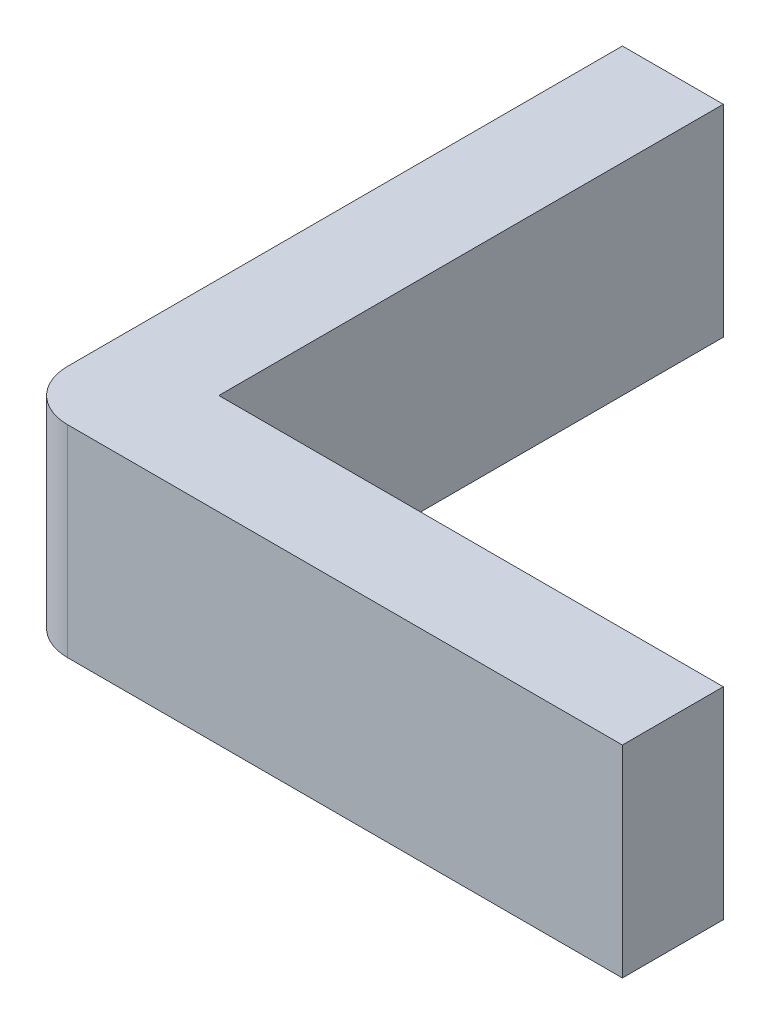
ISO-10303-21;
HEADER;
FILE_DESCRIPTION(('STEP AP214'),'2;1');
FILE_NAME('part.step','',(''),(''),'','','');
FILE_SCHEMA(('AUTOMOTIVE_DESIGN { 1 0 10303 214 1 1 1 1 }'));
ENDSEC;
DATA;
#1=APPLICATION_CONTEXT('core data for automotive mechanical design processes');
#2=APPLICATION_PROTOCOL_DEFINITION('international standard','automotive_design',2000,#1);
#3=PRODUCT_CONTEXT('',#1,'mechanical');
#4=PRODUCT('Part','Part','',(#3));
#5=PRODUCT_RELATED_PRODUCT_CATEGORY('part','',(#4));
#6=PRODUCT_DEFINITION_FORMATION('','',#4);
#7=PRODUCT_DEFINITION_CONTEXT('part definition',#1,'design');
#8=PRODUCT_DEFINITION('design','',#6,#7);
#9=PRODUCT_DEFINITION_SHAPE('','',#8);
#10=(LENGTH_UNIT() NAMED_UNIT(*) SI_UNIT(.MILLI.,.METRE.));
#11=(NAMED_UNIT(*) PLANE_ANGLE_UNIT() SI_UNIT($,.RADIAN.));
#12=(NAMED_UNIT(*) SI_UNIT($,.STERADIAN.) SOLID_ANGLE_UNIT());
#13=UNCERTAINTY_MEASURE_WITH_UNIT(LENGTH_MEASURE(1.E-05),#10,'distance_accuracy_value','');
#14=(GEOMETRIC_REPRESENTATION_CONTEXT(3) GLOBAL_UNCERTAINTY_ASSIGNED_CONTEXT((#13)) GLOBAL_UNIT_ASSIGNED_CONTEXT((#10,
#11,#12)) REPRESENTATION_CONTEXT('',''));
#15=CARTESIAN_POINT('',(0.,0.,0.));
#16=DIRECTION('',(0.,0.,1.));
#17=DIRECTION('',(1.,0.,0.));
#18=AXIS2_PLACEMENT_3D('',#15,#16,#17);
#19=CARTESIAN_POINT('',(0.,4.,-12.));
#20=DIRECTION('',(1.,0.,0.));
#21=DIRECTION('',(0.,0.,-1.));
#22=AXIS2_PLACEMENT_3D('',#19,#20,#21);
#23=PLANE('',#22);
#24=DIRECTION('',(0.,0.,1.));
#25=VECTOR('',#24,1.);
#26=CARTESIAN_POINT('',(0.,0.,-12.));
#27=LINE('',#26,#25);
#28=CARTESIAN_POINT('',(0.,0.,-12.));
#29=VERTEX_POINT('',#28);
#30=CARTESIAN_POINT('',(0.,0.,-0.999999999999999));
#31=VERTEX_POINT('',#30);
#32=EDGE_CURVE('E130',#29,#31,#27,.T.);
#33=ORIENTED_EDGE('',*,*,#32,.T.);
#34=DIRECTION('',(0.,-1.,0.));
#35=VECTOR('',#34,1.);
#36=CARTESIAN_POINT('',(0.,4.,-0.999999999999999));
#37=LINE('',#36,#35);
#38=CARTESIAN_POINT('',(0.,4.,-0.999999999999999));
#39=VERTEX_POINT('',#38);
#40=EDGE_CURVE('E46',#31,#39,#37,.F.);
#41=ORIENTED_EDGE('',*,*,#40,.T.);
#42=DIRECTION('',(0.,0.,1.));
#43=VECTOR('',#42,1.);
#44=CARTESIAN_POINT('',(0.,4.,-12.));
#45=LINE('',#44,#43);
#46=CARTESIAN_POINT('',(0.,4.,-12.));
#47=VERTEX_POINT('',#46);
#48=EDGE_CURVE('E106',#47,#39,#45,.T.);
#49=ORIENTED_EDGE('',*,*,#48,.F.);
#50=DIRECTION('',(0.,-1.,0.));
#51=VECTOR('',#50,1.);
#52=CARTESIAN_POINT('',(0.,4.,-12.));
#53=LINE('',#52,#51);
#54=EDGE_CURVE('E129',#47,#29,#53,.T.);
#55=ORIENTED_EDGE('',*,*,#54,.T.);
#56=EDGE_LOOP('',(#33,#41,#49,#55));
#57=FACE_BOUND('',#56,.T.);
#58=ADVANCED_FACE('F38',(#57),#23,.F.);
#59=CARTESIAN_POINT('',(0.,4.,0.));
#60=DIRECTION('',(0.,0.,-1.));
#61=DIRECTION('',(-1.,0.,0.));
#62=AXIS2_PLACEMENT_3D('',#59,#60,#61);
#63=PLANE('',#62);
#64=DIRECTION('',(1.,0.,0.));
#65=VECTOR('',#64,1.);
#66=CARTESIAN_POINT('',(0.,4.,0.));
#67=LINE('',#66,#65);
#68=CARTESIAN_POINT('',(1.,4.,0.));
#69=VERTEX_POINT('',#68);
#70=CARTESIAN_POINT('',(12.,4.,0.));
#71=VERTEX_POINT('',#70);
#72=EDGE_CURVE('E96',#69,#71,#67,.T.);
#73=ORIENTED_EDGE('',*,*,#72,.F.);
#74=DIRECTION('',(0.,-1.,0.));
#75=VECTOR('',#74,1.);
#76=CARTESIAN_POINT('',(1.,4.,0.));
#77=LINE('',#76,#75);
#78=CARTESIAN_POINT('',(1.,0.,0.));
#79=VERTEX_POINT('',#78);
#80=EDGE_CURVE('E114',#69,#79,#77,.T.);
#81=ORIENTED_EDGE('',*,*,#80,.T.);
#82=DIRECTION('',(1.,0.,0.));
#83=VECTOR('',#82,1.);
#84=CARTESIAN_POINT('',(0.,0.,0.));
#85=LINE('',#84,#83);
#86=CARTESIAN_POINT('',(12.,0.,0.));
#87=VERTEX_POINT('',#86);
#88=EDGE_CURVE('E111',#79,#87,#85,.T.);
#89=ORIENTED_EDGE('',*,*,#88,.T.);
#90=DIRECTION('',(0.,-1.,0.));
#91=VECTOR('',#90,1.);
#92=CARTESIAN_POINT('',(12.,4.,0.));
#93=LINE('',#92,#91);
#94=EDGE_CURVE('E109',#71,#87,#93,.T.);
#95=ORIENTED_EDGE('',*,*,#94,.F.);
#96=EDGE_LOOP('',(#73,#81,#89,#95));
#97=FACE_BOUND('',#96,.T.);
#98=ADVANCED_FACE('F110',(#97),#63,.F.);
#99=CARTESIAN_POINT('',(12.,4.,0.));
#100=DIRECTION('',(-1.,0.,0.));
#101=DIRECTION('',(0.,0.,1.));
#102=AXIS2_PLACEMENT_3D('',#99,#100,#101);
#103=PLANE('',#102);
#104=DIRECTION('',(0.,0.,-1.));
#105=VECTOR('',#104,1.);
#106=CARTESIAN_POINT('',(12.,0.,0.));
#107=LINE('',#106,#105);
#108=CARTESIAN_POINT('',(12.,0.,-2.));
#109=VERTEX_POINT('',#108);
#110=EDGE_CURVE('E133',#87,#109,#107,.T.);
#111=ORIENTED_EDGE('',*,*,#110,.T.);
#112=DIRECTION('',(0.,-1.,0.));
#113=VECTOR('',#112,1.);
#114=CARTESIAN_POINT('',(12.,4.,-2.));
#115=LINE('',#114,#113);
#116=CARTESIAN_POINT('',(12.,4.,-2.));
#117=VERTEX_POINT('',#116);
#118=EDGE_CURVE('E115',#117,#109,#115,.T.);
#119=ORIENTED_EDGE('',*,*,#118,.F.);
#120=DIRECTION('',(0.,0.,-1.));
#121=VECTOR('',#120,1.);
#122=CARTESIAN_POINT('',(12.,4.,0.));
#123=LINE('',#122,#121);
#124=EDGE_CURVE('E100',#71,#117,#123,.T.);
#125=ORIENTED_EDGE('',*,*,#124,.F.);
#126=ORIENTED_EDGE('',*,*,#94,.T.);
#127=EDGE_LOOP('',(#111,#119,#125,#126));
#128=FACE_BOUND('',#127,.T.);
#129=ADVANCED_FACE('F117',(#128),#103,.F.);
#130=CARTESIAN_POINT('',(12.,4.,-2.));
#131=DIRECTION('',(0.,0.,1.));
#132=DIRECTION('',(1.,0.,0.));
#133=AXIS2_PLACEMENT_3D('',#130,#131,#132);
#134=PLANE('',#133);
#135=DIRECTION('',(-1.,0.,0.));
#136=VECTOR('',#135,1.);
#137=CARTESIAN_POINT('',(12.,0.,-2.));
#138=LINE('',#137,#136);
#139=CARTESIAN_POINT('',(2.,0.,-2.));
#140=VERTEX_POINT('',#139);
#141=EDGE_CURVE('E135',#109,#140,#138,.T.);
#142=ORIENTED_EDGE('',*,*,#141,.T.);
#143=DIRECTION('',(0.,-1.,0.));
#144=VECTOR('',#143,1.);
#145=CARTESIAN_POINT('',(2.,4.,-2.));
#146=LINE('',#145,#144);
#147=CARTESIAN_POINT('',(2.,4.,-2.));
#148=VERTEX_POINT('',#147);
#149=EDGE_CURVE('E146',#148,#140,#146,.T.);
#150=ORIENTED_EDGE('',*,*,#149,.F.);
#151=DIRECTION('',(-1.,0.,0.));
#152=VECTOR('',#151,1.);
#153=CARTESIAN_POINT('',(12.,4.,-2.));
#154=LINE('',#153,#152);
#155=EDGE_CURVE('E120',#117,#148,#154,.T.);
#156=ORIENTED_EDGE('',*,*,#155,.F.);
#157=ORIENTED_EDGE('',*,*,#118,.T.);
#158=EDGE_LOOP('',(#142,#150,#156,#157));
#159=FACE_BOUND('',#158,.T.);
#160=ADVANCED_FACE('F156',(#159),#134,.F.);
#161=CARTESIAN_POINT('',(2.,4.,-2.));
#162=DIRECTION('',(-1.,0.,0.));
#163=DIRECTION('',(0.,0.,1.));
#164=AXIS2_PLACEMENT_3D('',#161,#162,#163);
#165=PLANE('',#164);
#166=DIRECTION('',(0.,0.,-1.));
#167=VECTOR('',#166,1.);
#168=CARTESIAN_POINT('',(2.,0.,-2.));
#169=LINE('',#168,#167);
#170=CARTESIAN_POINT('',(2.,0.,-12.));
#171=VERTEX_POINT('',#170);
#172=EDGE_CURVE('E137',#140,#171,#169,.T.);
#173=ORIENTED_EDGE('',*,*,#172,.T.);
#174=DIRECTION('',(0.,-1.,0.));
#175=VECTOR('',#174,1.);
#176=CARTESIAN_POINT('',(2.,4.,-12.));
#177=LINE('',#176,#175);
#178=CARTESIAN_POINT('',(2.,4.,-12.));
#179=VERTEX_POINT('',#178);
#180=EDGE_CURVE('E143',#179,#171,#177,.T.);
#181=ORIENTED_EDGE('',*,*,#180,.F.);
#182=DIRECTION('',(0.,0.,-1.));
#183=VECTOR('',#182,1.);
#184=CARTESIAN_POINT('',(2.,4.,-2.));
#185=LINE('',#184,#183);
#186=EDGE_CURVE('E122',#148,#179,#185,.T.);
#187=ORIENTED_EDGE('',*,*,#186,.F.);
#188=ORIENTED_EDGE('',*,*,#149,.T.);
#189=EDGE_LOOP('',(#173,#181,#187,#188));
#190=FACE_BOUND('',#189,.T.);
#191=ADVANCED_FACE('F163',(#190),#165,.F.);
#192=CARTESIAN_POINT('',(2.,4.,-12.));
#193=DIRECTION('',(0.,0.,1.));
#194=DIRECTION('',(1.,0.,0.));
#195=AXIS2_PLACEMENT_3D('',#192,#193,#194);
#196=PLANE('',#195);
#197=DIRECTION('',(-1.,0.,0.));
#198=VECTOR('',#197,1.);
#199=CARTESIAN_POINT('',(2.,0.,-12.));
#200=LINE('',#199,#198);
#201=EDGE_CURVE('E139',#171,#29,#200,.T.);
#202=ORIENTED_EDGE('',*,*,#201,.T.);
#203=ORIENTED_EDGE('',*,*,#54,.F.);
#204=DIRECTION('',(-1.,0.,0.));
#205=VECTOR('',#204,1.);
#206=CARTESIAN_POINT('',(2.,4.,-12.));
#207=LINE('',#206,#205);
#208=EDGE_CURVE('E127',#179,#47,#207,.T.);
#209=ORIENTED_EDGE('',*,*,#208,.F.);
#210=ORIENTED_EDGE('',*,*,#180,.T.);
#211=EDGE_LOOP('',(#202,#203,#209,#210));
#212=FACE_BOUND('',#211,.T.);
#213=ADVANCED_FACE('F166',(#212),#196,.F.);
#214=CARTESIAN_POINT('',(0.,4.,0.));
#215=DIRECTION('',(0.,1.,0.));
#216=DIRECTION('',(0.,0.,1.));
#217=AXIS2_PLACEMENT_3D('',#214,#215,#216);
#218=PLANE('',#217);
#219=ORIENTED_EDGE('',*,*,#48,.T.);
#220=CARTESIAN_POINT('',(1.,4.,-1.));
#221=DIRECTION('',(0.,1.,0.));
#222=DIRECTION('',(0.,0.,1.));
#223=AXIS2_PLACEMENT_3D('',#220,#221,#222);
#224=CIRCLE('',#223,1.);
#225=EDGE_CURVE('E11',#39,#69,#224,.T.);
#226=ORIENTED_EDGE('',*,*,#225,.T.);
#227=ORIENTED_EDGE('',*,*,#72,.T.);
#228=ORIENTED_EDGE('',*,*,#124,.T.);
#229=ORIENTED_EDGE('',*,*,#155,.T.);
#230=ORIENTED_EDGE('',*,*,#186,.T.);
#231=ORIENTED_EDGE('',*,*,#208,.T.);
#232=EDGE_LOOP('',(#219,#226,#227,#228,#229,#230,#231));
#233=FACE_BOUND('',#232,.T.);
#234=ADVANCED_FACE('F98',(#233),#218,.T.);
#235=CARTESIAN_POINT('',(0.,0.,0.));
#236=DIRECTION('',(0.,1.,0.));
#237=DIRECTION('',(0.,0.,1.));
#238=AXIS2_PLACEMENT_3D('',#235,#236,#237);
#239=PLANE('',#238);
#240=ORIENTED_EDGE('',*,*,#88,.F.);
#241=CARTESIAN_POINT('',(1.,0.,-1.));
#242=DIRECTION('',(0.,1.,0.));
#243=DIRECTION('',(0.,0.,1.));
#244=AXIS2_PLACEMENT_3D('',#241,#242,#243);
#245=CIRCLE('',#244,1.);
#246=EDGE_CURVE('E60',#79,#31,#245,.F.);
#247=ORIENTED_EDGE('',*,*,#246,.T.);
#248=ORIENTED_EDGE('',*,*,#32,.F.);
#249=ORIENTED_EDGE('',*,*,#201,.F.);
#250=ORIENTED_EDGE('',*,*,#172,.F.);
#251=ORIENTED_EDGE('',*,*,#141,.F.);
#252=ORIENTED_EDGE('',*,*,#110,.F.);
#253=EDGE_LOOP('',(#240,#247,#248,#249,#250,#251,#252));
#254=FACE_BOUND('',#253,.T.);
#255=ADVANCED_FACE('F152',(#254),#239,.F.);
#256=CARTESIAN_POINT('',(1.,4.,-1.));
#257=DIRECTION('',(0.,-1.,0.));
#258=DIRECTION('',(0.,0.,-1.));
#259=AXIS2_PLACEMENT_3D('',#256,#257,#258);
#260=CYLINDRICAL_SURFACE('',#259,1.);
#261=ORIENTED_EDGE('',*,*,#225,.F.);
#262=ORIENTED_EDGE('',*,*,#40,.F.);
#263=ORIENTED_EDGE('',*,*,#246,.F.);
#264=ORIENTED_EDGE('',*,*,#80,.F.);
#265=EDGE_LOOP('',(#261,#262,#263,#264));
#266=FACE_BOUND('',#265,.T.);
#267=ADVANCED_FACE('F40',(#266),#260,.T.);
#268=CLOSED_SHELL('',(#58,#98,#129,#160,#191,#213,#234,#255,#267));
#269=MANIFOLD_SOLID_BREP('B2',#268);
#270=ADVANCED_BREP_SHAPE_REPRESENTATION('',(#18,#269),#14);
#271=SHAPE_DEFINITION_REPRESENTATION(#9,#270);
ENDSEC;
END-ISO-10303-21;
